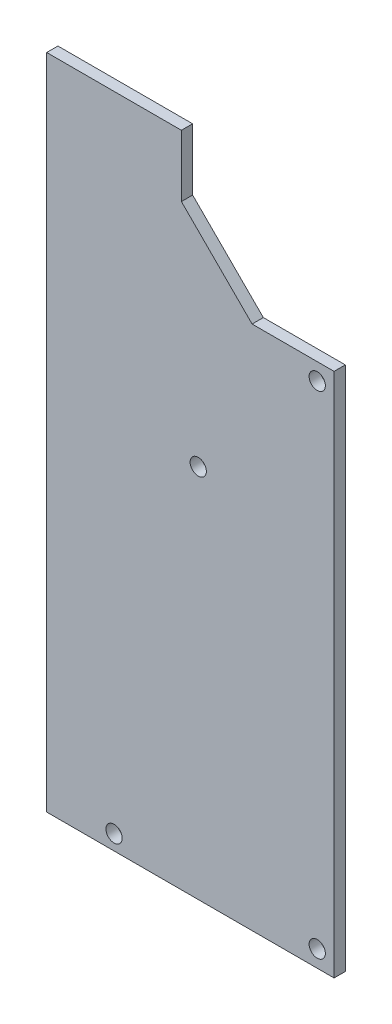
ISO-10303-21;
HEADER;
FILE_DESCRIPTION(('STEP AP214'),'2;1');
FILE_NAME('part.step','',(''),(''),'','','');
FILE_SCHEMA(('AUTOMOTIVE_DESIGN { 1 0 10303 214 1 1 1 1 }'));
ENDSEC;
DATA;
#1=APPLICATION_CONTEXT('core data for automotive mechanical design processes');
#2=APPLICATION_PROTOCOL_DEFINITION('international standard','automotive_design',2000,#1);
#3=PRODUCT_CONTEXT('',#1,'mechanical');
#4=PRODUCT('Part','Part','',(#3));
#5=PRODUCT_RELATED_PRODUCT_CATEGORY('part','',(#4));
#6=PRODUCT_DEFINITION_FORMATION('','',#4);
#7=PRODUCT_DEFINITION_CONTEXT('part definition',#1,'design');
#8=PRODUCT_DEFINITION('design','',#6,#7);
#9=PRODUCT_DEFINITION_SHAPE('','',#8);
#10=(LENGTH_UNIT() NAMED_UNIT(*) SI_UNIT(.MILLI.,.METRE.));
#11=(NAMED_UNIT(*) PLANE_ANGLE_UNIT() SI_UNIT($,.RADIAN.));
#12=(NAMED_UNIT(*) SI_UNIT($,.STERADIAN.) SOLID_ANGLE_UNIT());
#13=UNCERTAINTY_MEASURE_WITH_UNIT(LENGTH_MEASURE(1.E-05),#10,'distance_accuracy_value','');
#14=(GEOMETRIC_REPRESENTATION_CONTEXT(3) GLOBAL_UNCERTAINTY_ASSIGNED_CONTEXT((#13)) GLOBAL_UNIT_ASSIGNED_CONTEXT((#10,
#11,#12)) REPRESENTATION_CONTEXT('',''));
#15=CARTESIAN_POINT('',(0.,0.,0.));
#16=DIRECTION('',(0.,0.,1.));
#17=DIRECTION('',(1.,0.,0.));
#18=AXIS2_PLACEMENT_3D('',#15,#16,#17);
#19=CARTESIAN_POINT('',(12.541250000009,-5.30825000000956,1.58749999999999));
#20=DIRECTION('',(-1.,0.,0.));
#21=DIRECTION('',(0.,0.,1.));
#22=AXIS2_PLACEMENT_3D('',#19,#20,#21);
#23=PLANE('',#22);
#24=DIRECTION('',(0.,1.,0.));
#25=VECTOR('',#24,1.);
#26=CARTESIAN_POINT('',(12.541250000009,-5.30825000000956,1.58749999999999));
#27=LINE('',#26,#25);
#28=CARTESIAN_POINT('',(12.541250000009,76.446749999988,1.58750000000011));
#29=VERTEX_POINT('',#28);
#30=CARTESIAN_POINT('',(12.541250000009,85.179249999989,1.58750000000011));
#31=VERTEX_POINT('',#30);
#32=EDGE_CURVE('E167',#29,#31,#27,.T.);
#33=ORIENTED_EDGE('',*,*,#32,.F.);
#34=DIRECTION('',(0.,0.,-1.));
#35=VECTOR('',#34,1.);
#36=CARTESIAN_POINT('',(12.541250000009,76.446749999988,1.58750000000011));
#37=LINE('',#36,#35);
#38=CARTESIAN_POINT('',(12.541250000009,76.446749999988,1.15359111152458E-13));
#39=VERTEX_POINT('',#38);
#40=EDGE_CURVE('E78',#29,#39,#37,.T.);
#41=ORIENTED_EDGE('',*,*,#40,.T.);
#42=DIRECTION('',(0.,1.,0.));
#43=VECTOR('',#42,1.);
#44=CARTESIAN_POINT('',(12.541250000009,-5.30825000000956,0.));
#45=LINE('',#44,#43);
#46=CARTESIAN_POINT('',(12.541250000009,85.179249999989,1.15359111152458E-13));
#47=VERTEX_POINT('',#46);
#48=EDGE_CURVE('E112',#39,#47,#45,.T.);
#49=ORIENTED_EDGE('',*,*,#48,.T.);
#50=DIRECTION('',(0.,0.,1.));
#51=VECTOR('',#50,1.);
#52=CARTESIAN_POINT('',(12.541250000009,85.179249999989,1.15359111152458E-13));
#53=LINE('',#52,#51);
#54=EDGE_CURVE('E114',#47,#31,#53,.T.);
#55=ORIENTED_EDGE('',*,*,#54,.T.);
#56=EDGE_LOOP('',(#33,#41,#49,#55));
#57=FACE_BOUND('',#56,.T.);
#58=ADVANCED_FACE('F57',(#57),#23,.F.);
#59=CARTESIAN_POINT('',(-6.50874999999883,-5.3082500000096,1.5875000000001));
#60=DIRECTION('',(1.,0.,0.));
#61=DIRECTION('',(0.,0.,-1.));
#62=AXIS2_PLACEMENT_3D('',#59,#60,#61);
#63=PLANE('',#62);
#64=DIRECTION('',(0.,-1.,0.));
#65=VECTOR('',#64,1.);
#66=CARTESIAN_POINT('',(-6.50874999999883,-5.3082500000096,1.11022302462516E-13));
#67=LINE('',#66,#65);
#68=CARTESIAN_POINT('',(-6.50874999999879,85.1792499999889,1.17093834628434E-13));
#69=VERTEX_POINT('',#68);
#70=CARTESIAN_POINT('',(-6.50874999999883,-7.8482500000096,1.11022302462516E-13));
#71=VERTEX_POINT('',#70);
#72=EDGE_CURVE('E120',#69,#71,#67,.T.);
#73=ORIENTED_EDGE('',*,*,#72,.T.);
#74=DIRECTION('',(0.,0.,1.));
#75=VECTOR('',#74,1.);
#76=CARTESIAN_POINT('',(-6.50874999999883,-7.8482500000096,1.11022302462516E-13));
#77=LINE('',#76,#75);
#78=CARTESIAN_POINT('',(-6.50874999999883,-7.8482500000096,1.5875000000001));
#79=VERTEX_POINT('',#78);
#80=EDGE_CURVE('E145',#71,#79,#77,.T.);
#81=ORIENTED_EDGE('',*,*,#80,.T.);
#82=DIRECTION('',(0.,-1.,0.));
#83=VECTOR('',#82,1.);
#84=CARTESIAN_POINT('',(-6.50874999999883,-5.3082500000096,1.5875000000001));
#85=LINE('',#84,#83);
#86=CARTESIAN_POINT('',(-6.50874999999879,85.1792499999889,1.58750000000011));
#87=VERTEX_POINT('',#86);
#88=EDGE_CURVE('E119',#87,#79,#85,.T.);
#89=ORIENTED_EDGE('',*,*,#88,.F.);
#90=DIRECTION('',(0.,0.,1.));
#91=VECTOR('',#90,1.);
#92=CARTESIAN_POINT('',(-6.50874999999879,85.1792499999889,1.17093834628434E-13));
#93=LINE('',#92,#91);
#94=EDGE_CURVE('E129',#69,#87,#93,.T.);
#95=ORIENTED_EDGE('',*,*,#94,.F.);
#96=EDGE_LOOP('',(#73,#81,#89,#95));
#97=FACE_BOUND('',#96,.T.);
#98=ADVANCED_FACE('F195',(#97),#63,.F.);
#99=CARTESIAN_POINT('',(0.,0.,1.58749999999999));
#100=DIRECTION('',(0.,0.,-1.));
#101=DIRECTION('',(-1.,0.,0.));
#102=AXIS2_PLACEMENT_3D('',#99,#100,#101);
#103=PLANE('',#102);
#104=CARTESIAN_POINT('',(14.9225000000062,45.1654999999886,1.58750000000011));
#105=DIRECTION('',(0.,0.,1.));
#106=DIRECTION('',(1.,0.,0.));
#107=AXIS2_PLACEMENT_3D('',#104,#105,#106);
#108=CIRCLE('',#107,1.15);
#109=CARTESIAN_POINT('',(16.0725000000062,45.1654999999886,1.58750000000011));
#110=VERTEX_POINT('',#109);
#111=EDGE_CURVE('E235',#110,#110,#108,.T.);
#112=ORIENTED_EDGE('',*,*,#111,.F.);
#113=EDGE_LOOP('',(#112));
#114=FACE_BOUND('',#113,.T.);
#115=CARTESIAN_POINT('',(31.7500000000085,64.0654999999883,1.58750000000011));
#116=DIRECTION('',(0.,0.,1.));
#117=DIRECTION('',(1.,0.,0.));
#118=AXIS2_PLACEMENT_3D('',#115,#116,#117);
#119=CIRCLE('',#118,1.15);
#120=CARTESIAN_POINT('',(32.9000000000085,64.0654999999883,1.58750000000011));
#121=VERTEX_POINT('',#120);
#122=EDGE_CURVE('E237',#121,#121,#119,.T.);
#123=ORIENTED_EDGE('',*,*,#122,.F.);
#124=EDGE_LOOP('',(#123));
#125=FACE_BOUND('',#124,.T.);
#126=CARTESIAN_POINT('',(31.7500000000088,-5.46700000000933,1.58749999999999));
#127=DIRECTION('',(0.,0.,1.));
#128=DIRECTION('',(1.,0.,0.));
#129=AXIS2_PLACEMENT_3D('',#126,#127,#128);
#130=CIRCLE('',#129,1.15);
#131=CARTESIAN_POINT('',(32.9000000000088,-5.46700000000933,1.58749999999999));
#132=VERTEX_POINT('',#131);
#133=EDGE_CURVE('E245',#132,#132,#130,.T.);
#134=ORIENTED_EDGE('',*,*,#133,.F.);
#135=EDGE_LOOP('',(#134));
#136=FACE_BOUND('',#135,.T.);
#137=CARTESIAN_POINT('',(3.01624999999687,-5.72100000000715,1.58749999999999));
#138=DIRECTION('',(0.,0.,1.));
#139=DIRECTION('',(1.,0.,0.));
#140=AXIS2_PLACEMENT_3D('',#137,#138,#139);
#141=CIRCLE('',#140,1.15);
#142=CARTESIAN_POINT('',(4.16624999999687,-5.72100000000715,1.58749999999999));
#143=VERTEX_POINT('',#142);
#144=EDGE_CURVE('E250',#143,#143,#141,.T.);
#145=ORIENTED_EDGE('',*,*,#144,.F.);
#146=EDGE_LOOP('',(#145));
#147=FACE_BOUND('',#146,.T.);
#148=ORIENTED_EDGE('',*,*,#88,.T.);
#149=DIRECTION('',(1.,0.,0.));
#150=VECTOR('',#149,1.);
#151=CARTESIAN_POINT('',(34.1312500000086,-7.84825000000956,1.58749999999999));
#152=LINE('',#151,#150);
#153=CARTESIAN_POINT('',(34.1312500000086,-7.84825000000956,1.58749999999999));
#154=VERTEX_POINT('',#153);
#155=EDGE_CURVE('E140',#79,#154,#152,.T.);
#156=ORIENTED_EDGE('',*,*,#155,.T.);
#157=DIRECTION('',(0.,1.,0.));
#158=VECTOR('',#157,1.);
#159=CARTESIAN_POINT('',(34.1312500000086,-5.30825000000956,1.58749999999999));
#160=LINE('',#159,#158);
#161=CARTESIAN_POINT('',(34.1312500000087,66.446749999988,1.58750000000011));
#162=VERTEX_POINT('',#161);
#163=EDGE_CURVE('E151',#154,#162,#160,.T.);
#164=ORIENTED_EDGE('',*,*,#163,.T.);
#165=DIRECTION('',(-1.,0.,0.));
#166=VECTOR('',#165,1.);
#167=CARTESIAN_POINT('',(12.541250000009,66.4467499999881,1.58750000000011));
#168=LINE('',#167,#166);
#169=CARTESIAN_POINT('',(22.5412500000091,66.4467499999881,1.58750000000011));
#170=VERTEX_POINT('',#169);
#171=EDGE_CURVE('E158',#162,#170,#168,.T.);
#172=ORIENTED_EDGE('',*,*,#171,.T.);
#173=DIRECTION('',(-0.707106781186551,0.707106781186543,0.));
#174=VECTOR('',#173,1.);
#175=CARTESIAN_POINT('',(44.4939999999984,44.4939999999989,1.5875000000001));
#176=LINE('',#175,#174);
#177=EDGE_CURVE('E65',#170,#29,#176,.T.);
#178=ORIENTED_EDGE('',*,*,#177,.T.);
#179=ORIENTED_EDGE('',*,*,#32,.T.);
#180=DIRECTION('',(-1.,0.,0.));
#181=VECTOR('',#180,1.);
#182=CARTESIAN_POINT('',(12.541250000009,85.179249999989,1.58750000000011));
#183=LINE('',#182,#181);
#184=EDGE_CURVE('E128',#31,#87,#183,.T.);
#185=ORIENTED_EDGE('',*,*,#184,.T.);
#186=EDGE_LOOP('',(#148,#156,#164,#172,#178,#179,#185));
#187=FACE_BOUND('',#186,.T.);
#188=ADVANCED_FACE('F179',(#114,#125,#136,#147,#187),#103,.F.);
#189=CARTESIAN_POINT('',(0.,0.,0.));
#190=DIRECTION('',(0.,0.,-1.));
#191=DIRECTION('',(-1.,0.,0.));
#192=AXIS2_PLACEMENT_3D('',#189,#190,#191);
#193=PLANE('',#192);
#194=CARTESIAN_POINT('',(14.9225000000062,45.1654999999886,1.12757025938492E-13));
#195=DIRECTION('',(0.,0.,1.));
#196=DIRECTION('',(1.,0.,0.));
#197=AXIS2_PLACEMENT_3D('',#194,#195,#196);
#198=CIRCLE('',#197,1.15);
#199=CARTESIAN_POINT('',(16.0725000000062,45.1654999999886,1.12373998994997E-13));
#200=VERTEX_POINT('',#199);
#201=EDGE_CURVE('E232',#200,#200,#198,.T.);
#202=ORIENTED_EDGE('',*,*,#201,.T.);
#203=EDGE_LOOP('',(#202));
#204=FACE_BOUND('',#203,.T.);
#205=CARTESIAN_POINT('',(31.7500000000085,64.0654999999883,1.12757025938492E-13));
#206=DIRECTION('',(0.,0.,1.));
#207=DIRECTION('',(1.,0.,0.));
#208=AXIS2_PLACEMENT_3D('',#205,#206,#207);
#209=CIRCLE('',#208,1.15);
#210=CARTESIAN_POINT('',(32.9000000000085,64.0654999999883,1.12373998994997E-13));
#211=VERTEX_POINT('',#210);
#212=EDGE_CURVE('E242',#211,#211,#209,.T.);
#213=ORIENTED_EDGE('',*,*,#212,.T.);
#214=EDGE_LOOP('',(#213));
#215=FACE_BOUND('',#214,.T.);
#216=CARTESIAN_POINT('',(31.7500000000088,-5.46700000000933,0.));
#217=DIRECTION('',(0.,0.,1.));
#218=DIRECTION('',(1.,0.,0.));
#219=AXIS2_PLACEMENT_3D('',#216,#217,#218);
#220=CIRCLE('',#219,1.15);
#221=CARTESIAN_POINT('',(32.9000000000088,-5.46700000000933,0.));
#222=VERTEX_POINT('',#221);
#223=EDGE_CURVE('E248',#222,#222,#220,.T.);
#224=ORIENTED_EDGE('',*,*,#223,.T.);
#225=EDGE_LOOP('',(#224));
#226=FACE_BOUND('',#225,.T.);
#227=CARTESIAN_POINT('',(3.01624999999687,-5.72100000000715,0.));
#228=DIRECTION('',(0.,0.,1.));
#229=DIRECTION('',(1.,0.,0.));
#230=AXIS2_PLACEMENT_3D('',#227,#228,#229);
#231=CIRCLE('',#230,1.15);
#232=CARTESIAN_POINT('',(4.16624999999687,-5.72100000000715,0.));
#233=VERTEX_POINT('',#232);
#234=EDGE_CURVE('E135',#233,#233,#231,.T.);
#235=ORIENTED_EDGE('',*,*,#234,.T.);
#236=EDGE_LOOP('',(#235));
#237=FACE_BOUND('',#236,.T.);
#238=ORIENTED_EDGE('',*,*,#72,.F.);
#239=DIRECTION('',(-1.,0.,0.));
#240=VECTOR('',#239,1.);
#241=CARTESIAN_POINT('',(12.541250000009,85.179249999989,1.15359111152458E-13));
#242=LINE('',#241,#240);
#243=EDGE_CURVE('E126',#47,#69,#242,.T.);
#244=ORIENTED_EDGE('',*,*,#243,.F.);
#245=ORIENTED_EDGE('',*,*,#48,.F.);
#246=DIRECTION('',(0.707106781186551,-0.707106781186543,0.));
#247=VECTOR('',#246,1.);
#248=CARTESIAN_POINT('',(22.5412500000091,66.4467499999881,1.14491749414469E-13));
#249=LINE('',#248,#247);
#250=CARTESIAN_POINT('',(22.5412500000091,66.4467499999881,1.14491749414469E-13));
#251=VERTEX_POINT('',#250);
#252=EDGE_CURVE('E13',#39,#251,#249,.T.);
#253=ORIENTED_EDGE('',*,*,#252,.T.);
#254=DIRECTION('',(-1.,0.,0.));
#255=VECTOR('',#254,1.);
#256=CARTESIAN_POINT('',(12.541250000009,66.4467499999881,1.14491749414469E-13));
#257=LINE('',#256,#255);
#258=CARTESIAN_POINT('',(34.1312500000087,66.446749999988,1.12757025938492E-13));
#259=VERTEX_POINT('',#258);
#260=EDGE_CURVE('E157',#259,#251,#257,.T.);
#261=ORIENTED_EDGE('',*,*,#260,.F.);
#262=DIRECTION('',(0.,1.,0.));
#263=VECTOR('',#262,1.);
#264=CARTESIAN_POINT('',(34.1312500000086,-5.30825000000956,0.));
#265=LINE('',#264,#263);
#266=CARTESIAN_POINT('',(34.1312500000086,-7.84825000000956,0.));
#267=VERTEX_POINT('',#266);
#268=EDGE_CURVE('E154',#267,#259,#265,.T.);
#269=ORIENTED_EDGE('',*,*,#268,.F.);
#270=DIRECTION('',(1.,0.,0.));
#271=VECTOR('',#270,1.);
#272=CARTESIAN_POINT('',(34.1312500000086,-7.84825000000956,0.));
#273=LINE('',#272,#271);
#274=EDGE_CURVE('E142',#71,#267,#273,.T.);
#275=ORIENTED_EDGE('',*,*,#274,.F.);
#276=EDGE_LOOP('',(#238,#244,#245,#253,#261,#269,#275));
#277=FACE_BOUND('',#276,.T.);
#278=ADVANCED_FACE('F131',(#204,#215,#226,#237,#277),#193,.T.);
#279=CARTESIAN_POINT('',(12.541250000009,66.4467499999881,1.14491749414469E-13));
#280=DIRECTION('',(0.,1.,0.));
#281=DIRECTION('',(0.,0.,1.));
#282=AXIS2_PLACEMENT_3D('',#279,#280,#281);
#283=PLANE('',#282);
#284=ORIENTED_EDGE('',*,*,#260,.T.);
#285=DIRECTION('',(0.,0.,1.));
#286=VECTOR('',#285,1.);
#287=CARTESIAN_POINT('',(22.5412500000091,66.4467499999881,1.14491749414469E-13));
#288=LINE('',#287,#286);
#289=EDGE_CURVE('E169',#251,#170,#288,.T.);
#290=ORIENTED_EDGE('',*,*,#289,.T.);
#291=ORIENTED_EDGE('',*,*,#171,.F.);
#292=DIRECTION('',(0.,0.,1.));
#293=VECTOR('',#292,1.);
#294=CARTESIAN_POINT('',(34.1312500000087,66.446749999988,1.12757025938492E-13));
#295=LINE('',#294,#293);
#296=EDGE_CURVE('E161',#259,#162,#295,.T.);
#297=ORIENTED_EDGE('',*,*,#296,.F.);
#298=EDGE_LOOP('',(#284,#290,#291,#297));
#299=FACE_BOUND('',#298,.T.);
#300=ADVANCED_FACE('F176',(#299),#283,.T.);
#301=CARTESIAN_POINT('',(34.1312500000086,-5.30825000000956,0.));
#302=DIRECTION('',(1.,0.,0.));
#303=DIRECTION('',(0.,0.,-1.));
#304=AXIS2_PLACEMENT_3D('',#301,#302,#303);
#305=PLANE('',#304);
#306=ORIENTED_EDGE('',*,*,#163,.F.);
#307=DIRECTION('',(0.,0.,1.));
#308=VECTOR('',#307,1.);
#309=CARTESIAN_POINT('',(34.1312500000086,-7.84825000000956,0.));
#310=LINE('',#309,#308);
#311=EDGE_CURVE('E148',#267,#154,#310,.T.);
#312=ORIENTED_EDGE('',*,*,#311,.F.);
#313=ORIENTED_EDGE('',*,*,#268,.T.);
#314=ORIENTED_EDGE('',*,*,#296,.T.);
#315=EDGE_LOOP('',(#306,#312,#313,#314));
#316=FACE_BOUND('',#315,.T.);
#317=ADVANCED_FACE('F183',(#316),#305,.T.);
#318=CARTESIAN_POINT('',(22.5412500000091,66.4467499999881,1.14491749414469E-13));
#319=DIRECTION('',(-0.707106781186544,-0.707106781186552,0.));
#320=DIRECTION('',(0.,0.,1.));
#321=AXIS2_PLACEMENT_3D('',#318,#319,#320);
#322=PLANE('',#321);
#323=ORIENTED_EDGE('',*,*,#252,.F.);
#324=ORIENTED_EDGE('',*,*,#40,.F.);
#325=ORIENTED_EDGE('',*,*,#177,.F.);
#326=ORIENTED_EDGE('',*,*,#289,.F.);
#327=EDGE_LOOP('',(#323,#324,#325,#326));
#328=FACE_BOUND('',#327,.T.);
#329=ADVANCED_FACE('F59',(#328),#322,.F.);
#330=CARTESIAN_POINT('',(34.1312500000086,-7.84825000000956,0.));
#331=DIRECTION('',(0.,-1.,0.));
#332=DIRECTION('',(1.,0.,0.));
#333=AXIS2_PLACEMENT_3D('',#330,#331,#332);
#334=PLANE('',#333);
#335=ORIENTED_EDGE('',*,*,#155,.F.);
#336=ORIENTED_EDGE('',*,*,#80,.F.);
#337=ORIENTED_EDGE('',*,*,#274,.T.);
#338=ORIENTED_EDGE('',*,*,#311,.T.);
#339=EDGE_LOOP('',(#335,#336,#337,#338));
#340=FACE_BOUND('',#339,.T.);
#341=ADVANCED_FACE('F185',(#340),#334,.T.);
#342=CARTESIAN_POINT('',(12.541250000009,85.179249999989,1.15359111152458E-13));
#343=DIRECTION('',(0.,1.,0.));
#344=DIRECTION('',(0.,0.,1.));
#345=AXIS2_PLACEMENT_3D('',#342,#343,#344);
#346=PLANE('',#345);
#347=ORIENTED_EDGE('',*,*,#184,.F.);
#348=ORIENTED_EDGE('',*,*,#54,.F.);
#349=ORIENTED_EDGE('',*,*,#243,.T.);
#350=ORIENTED_EDGE('',*,*,#94,.T.);
#351=EDGE_LOOP('',(#347,#348,#349,#350));
#352=FACE_BOUND('',#351,.T.);
#353=ADVANCED_FACE('F124',(#352),#346,.T.);
#354=CARTESIAN_POINT('',(3.01624999999687,-5.72100000000715,1.58749999999999));
#355=DIRECTION('',(0.,0.,1.));
#356=DIRECTION('',(1.,0.,0.));
#357=AXIS2_PLACEMENT_3D('',#354,#355,#356);
#358=CYLINDRICAL_SURFACE('',#357,1.15);
#359=ORIENTED_EDGE('',*,*,#234,.F.);
#360=EDGE_LOOP('',(#359));
#361=FACE_BOUND('',#360,.T.);
#362=ORIENTED_EDGE('',*,*,#144,.T.);
#363=EDGE_LOOP('',(#362));
#364=FACE_BOUND('',#363,.T.);
#365=ADVANCED_FACE('F212',(#361,#364),#358,.F.);
#366=CARTESIAN_POINT('',(31.7500000000088,-5.46700000000933,1.58749999999999));
#367=DIRECTION('',(0.,0.,1.));
#368=DIRECTION('',(1.,0.,0.));
#369=AXIS2_PLACEMENT_3D('',#366,#367,#368);
#370=CYLINDRICAL_SURFACE('',#369,1.15);
#371=ORIENTED_EDGE('',*,*,#223,.F.);
#372=EDGE_LOOP('',(#371));
#373=FACE_BOUND('',#372,.T.);
#374=ORIENTED_EDGE('',*,*,#133,.T.);
#375=EDGE_LOOP('',(#374));
#376=FACE_BOUND('',#375,.T.);
#377=ADVANCED_FACE('F215',(#373,#376),#370,.F.);
#378=CARTESIAN_POINT('',(31.7500000000085,64.0654999999883,1.58750000000011));
#379=DIRECTION('',(0.,0.,1.));
#380=DIRECTION('',(1.,0.,0.));
#381=AXIS2_PLACEMENT_3D('',#378,#379,#380);
#382=CYLINDRICAL_SURFACE('',#381,1.15);
#383=ORIENTED_EDGE('',*,*,#212,.F.);
#384=EDGE_LOOP('',(#383));
#385=FACE_BOUND('',#384,.T.);
#386=ORIENTED_EDGE('',*,*,#122,.T.);
#387=EDGE_LOOP('',(#386));
#388=FACE_BOUND('',#387,.T.);
#389=ADVANCED_FACE('F219',(#385,#388),#382,.F.);
#390=CARTESIAN_POINT('',(14.9225000000062,45.1654999999886,1.58750000000011));
#391=DIRECTION('',(0.,0.,1.));
#392=DIRECTION('',(1.,0.,0.));
#393=AXIS2_PLACEMENT_3D('',#390,#391,#392);
#394=CYLINDRICAL_SURFACE('',#393,1.15);
#395=ORIENTED_EDGE('',*,*,#201,.F.);
#396=EDGE_LOOP('',(#395));
#397=FACE_BOUND('',#396,.T.);
#398=ORIENTED_EDGE('',*,*,#111,.T.);
#399=EDGE_LOOP('',(#398));
#400=FACE_BOUND('',#399,.T.);
#401=ADVANCED_FACE('F223',(#397,#400),#394,.F.);
#402=CLOSED_SHELL('',(#58,#98,#188,#278,#300,#317,#329,#341,#353,#365,#377,#389,#401));
#403=MANIFOLD_SOLID_BREP('B2',#402);
#404=ADVANCED_BREP_SHAPE_REPRESENTATION('',(#18,#403),#14);
#405=SHAPE_DEFINITION_REPRESENTATION(#9,#404);
ENDSEC;
END-ISO-10303-21;
